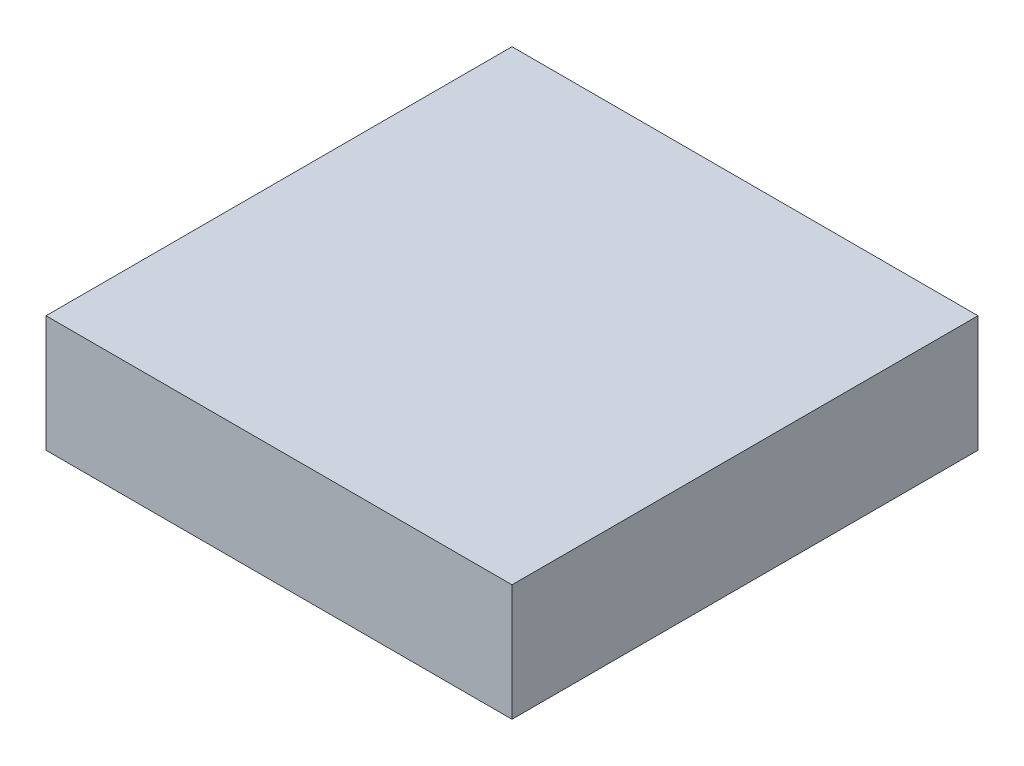
ISO-10303-21;
HEADER;
FILE_DESCRIPTION(('STEP AP214'),'2;1');
FILE_NAME('part.step','',(''),(''),'','','');
FILE_SCHEMA(('AUTOMOTIVE_DESIGN { 1 0 10303 214 1 1 1 1 }'));
ENDSEC;
DATA;
#1=APPLICATION_CONTEXT('core data for automotive mechanical design processes');
#2=APPLICATION_PROTOCOL_DEFINITION('international standard','automotive_design',2000,#1);
#3=PRODUCT_CONTEXT('',#1,'mechanical');
#4=PRODUCT('Part','Part','',(#3));
#5=PRODUCT_RELATED_PRODUCT_CATEGORY('part','',(#4));
#6=PRODUCT_DEFINITION_FORMATION('','',#4);
#7=PRODUCT_DEFINITION_CONTEXT('part definition',#1,'design');
#8=PRODUCT_DEFINITION('design','',#6,#7);
#9=PRODUCT_DEFINITION_SHAPE('','',#8);
#10=(LENGTH_UNIT() NAMED_UNIT(*) SI_UNIT(.MILLI.,.METRE.));
#11=(NAMED_UNIT(*) PLANE_ANGLE_UNIT() SI_UNIT($,.RADIAN.));
#12=(NAMED_UNIT(*) SI_UNIT($,.STERADIAN.) SOLID_ANGLE_UNIT());
#13=UNCERTAINTY_MEASURE_WITH_UNIT(LENGTH_MEASURE(1.E-05),#10,'distance_accuracy_value','');
#14=(GEOMETRIC_REPRESENTATION_CONTEXT(3) GLOBAL_UNCERTAINTY_ASSIGNED_CONTEXT((#13)) GLOBAL_UNIT_ASSIGNED_CONTEXT((#10,
#11,#12)) REPRESENTATION_CONTEXT('',''));
#15=CARTESIAN_POINT('',(0.,0.,0.));
#16=DIRECTION('',(0.,0.,1.));
#17=DIRECTION('',(1.,0.,0.));
#18=AXIS2_PLACEMENT_3D('',#15,#16,#17);
#19=CARTESIAN_POINT('',(12.7,6.35,12.7));
#20=DIRECTION('',(-1.,0.,0.));
#21=DIRECTION('',(0.,0.,1.));
#22=AXIS2_PLACEMENT_3D('',#19,#20,#21);
#23=PLANE('',#22);
#24=DIRECTION('',(0.,0.,-1.));
#25=VECTOR('',#24,1.);
#26=CARTESIAN_POINT('',(12.7,0.,12.7));
#27=LINE('',#26,#25);
#28=CARTESIAN_POINT('',(12.7,0.,12.7));
#29=VERTEX_POINT('',#28);
#30=CARTESIAN_POINT('',(12.7,0.,-12.7));
#31=VERTEX_POINT('',#30);
#32=EDGE_CURVE('E107',#29,#31,#27,.T.);
#33=ORIENTED_EDGE('',*,*,#32,.T.);
#34=DIRECTION('',(0.,-1.,0.));
#35=VECTOR('',#34,1.);
#36=CARTESIAN_POINT('',(12.7,6.35,-12.7));
#37=LINE('',#36,#35);
#38=CARTESIAN_POINT('',(12.7,6.35,-12.7));
#39=VERTEX_POINT('',#38);
#40=EDGE_CURVE('E11',#39,#31,#37,.T.);
#41=ORIENTED_EDGE('',*,*,#40,.F.);
#42=DIRECTION('',(0.,0.,-1.));
#43=VECTOR('',#42,1.);
#44=CARTESIAN_POINT('',(12.7,6.35,12.7));
#45=LINE('',#44,#43);
#46=CARTESIAN_POINT('',(12.7,6.35,12.7));
#47=VERTEX_POINT('',#46);
#48=EDGE_CURVE('E91',#47,#39,#45,.T.);
#49=ORIENTED_EDGE('',*,*,#48,.F.);
#50=DIRECTION('',(0.,-1.,0.));
#51=VECTOR('',#50,1.);
#52=CARTESIAN_POINT('',(12.7,6.35,12.7));
#53=LINE('',#52,#51);
#54=EDGE_CURVE('E103',#47,#29,#53,.T.);
#55=ORIENTED_EDGE('',*,*,#54,.T.);
#56=EDGE_LOOP('',(#33,#41,#49,#55));
#57=FACE_BOUND('',#56,.T.);
#58=ADVANCED_FACE('F39',(#57),#23,.F.);
#59=CARTESIAN_POINT('',(-12.7,6.35,-12.7));
#60=DIRECTION('',(0.,0.,1.));
#61=DIRECTION('',(1.,0.,0.));
#62=AXIS2_PLACEMENT_3D('',#59,#60,#61);
#63=PLANE('',#62);
#64=DIRECTION('',(-1.,0.,0.));
#65=VECTOR('',#64,1.);
#66=CARTESIAN_POINT('',(-12.7,0.,-12.7));
#67=LINE('',#66,#65);
#68=CARTESIAN_POINT('',(-12.7,0.,-12.7));
#69=VERTEX_POINT('',#68);
#70=EDGE_CURVE('E96',#31,#69,#67,.T.);
#71=ORIENTED_EDGE('',*,*,#70,.T.);
#72=DIRECTION('',(0.,-1.,0.));
#73=VECTOR('',#72,1.);
#74=CARTESIAN_POINT('',(-12.7,6.35,-12.7));
#75=LINE('',#74,#73);
#76=CARTESIAN_POINT('',(-12.7,6.35,-12.7));
#77=VERTEX_POINT('',#76);
#78=EDGE_CURVE('E48',#77,#69,#75,.T.);
#79=ORIENTED_EDGE('',*,*,#78,.F.);
#80=DIRECTION('',(-1.,0.,0.));
#81=VECTOR('',#80,1.);
#82=CARTESIAN_POINT('',(-12.7,6.35,-12.7));
#83=LINE('',#82,#81);
#84=EDGE_CURVE('E86',#39,#77,#83,.T.);
#85=ORIENTED_EDGE('',*,*,#84,.F.);
#86=ORIENTED_EDGE('',*,*,#40,.T.);
#87=EDGE_LOOP('',(#71,#79,#85,#86));
#88=FACE_BOUND('',#87,.T.);
#89=ADVANCED_FACE('F95',(#88),#63,.F.);
#90=CARTESIAN_POINT('',(-12.7,6.35,12.7));
#91=DIRECTION('',(1.,0.,0.));
#92=DIRECTION('',(0.,0.,-1.));
#93=AXIS2_PLACEMENT_3D('',#90,#91,#92);
#94=PLANE('',#93);
#95=DIRECTION('',(0.,0.,1.));
#96=VECTOR('',#95,1.);
#97=CARTESIAN_POINT('',(-12.7,0.,12.7));
#98=LINE('',#97,#96);
#99=CARTESIAN_POINT('',(-12.7,0.,12.7));
#100=VERTEX_POINT('',#99);
#101=EDGE_CURVE('E73',#69,#100,#98,.T.);
#102=ORIENTED_EDGE('',*,*,#101,.T.);
#103=DIRECTION('',(0.,-1.,0.));
#104=VECTOR('',#103,1.);
#105=CARTESIAN_POINT('',(-12.7,6.35,12.7));
#106=LINE('',#105,#104);
#107=CARTESIAN_POINT('',(-12.7,6.35,12.7));
#108=VERTEX_POINT('',#107);
#109=EDGE_CURVE('E98',#108,#100,#106,.T.);
#110=ORIENTED_EDGE('',*,*,#109,.F.);
#111=DIRECTION('',(0.,0.,1.));
#112=VECTOR('',#111,1.);
#113=CARTESIAN_POINT('',(-12.7,6.35,12.7));
#114=LINE('',#113,#112);
#115=EDGE_CURVE('E89',#77,#108,#114,.T.);
#116=ORIENTED_EDGE('',*,*,#115,.F.);
#117=ORIENTED_EDGE('',*,*,#78,.T.);
#118=EDGE_LOOP('',(#102,#110,#116,#117));
#119=FACE_BOUND('',#118,.T.);
#120=ADVANCED_FACE('F99',(#119),#94,.F.);
#121=CARTESIAN_POINT('',(-12.7,6.35,12.7));
#122=DIRECTION('',(0.,0.,-1.));
#123=DIRECTION('',(-1.,0.,0.));
#124=AXIS2_PLACEMENT_3D('',#121,#122,#123);
#125=PLANE('',#124);
#126=DIRECTION('',(1.,0.,0.));
#127=VECTOR('',#126,1.);
#128=CARTESIAN_POINT('',(-12.7,0.,12.7));
#129=LINE('',#128,#127);
#130=EDGE_CURVE('E79',#100,#29,#129,.T.);
#131=ORIENTED_EDGE('',*,*,#130,.T.);
#132=ORIENTED_EDGE('',*,*,#54,.F.);
#133=DIRECTION('',(1.,0.,0.));
#134=VECTOR('',#133,1.);
#135=CARTESIAN_POINT('',(-12.7,6.35,12.7));
#136=LINE('',#135,#134);
#137=EDGE_CURVE('E56',#108,#47,#136,.T.);
#138=ORIENTED_EDGE('',*,*,#137,.F.);
#139=ORIENTED_EDGE('',*,*,#109,.T.);
#140=EDGE_LOOP('',(#131,#132,#138,#139));
#141=FACE_BOUND('',#140,.T.);
#142=ADVANCED_FACE('F120',(#141),#125,.F.);
#143=CARTESIAN_POINT('',(0.,6.35,0.));
#144=DIRECTION('',(0.,-1.,0.));
#145=DIRECTION('',(0.,0.,-1.));
#146=AXIS2_PLACEMENT_3D('',#143,#144,#145);
#147=PLANE('',#146);
#148=ORIENTED_EDGE('',*,*,#48,.T.);
#149=ORIENTED_EDGE('',*,*,#84,.T.);
#150=ORIENTED_EDGE('',*,*,#115,.T.);
#151=ORIENTED_EDGE('',*,*,#137,.T.);
#152=EDGE_LOOP('',(#148,#149,#150,#151));
#153=FACE_BOUND('',#152,.T.);
#154=ADVANCED_FACE('F87',(#153),#147,.F.);
#155=CARTESIAN_POINT('',(0.,0.,0.));
#156=DIRECTION('',(0.,-1.,0.));
#157=DIRECTION('',(0.,0.,-1.));
#158=AXIS2_PLACEMENT_3D('',#155,#156,#157);
#159=PLANE('',#158);
#160=ORIENTED_EDGE('',*,*,#32,.F.);
#161=ORIENTED_EDGE('',*,*,#130,.F.);
#162=ORIENTED_EDGE('',*,*,#101,.F.);
#163=ORIENTED_EDGE('',*,*,#70,.F.);
#164=EDGE_LOOP('',(#160,#161,#162,#163));
#165=FACE_BOUND('',#164,.T.);
#166=ADVANCED_FACE('F123',(#165),#159,.T.);
#167=CLOSED_SHELL('',(#58,#89,#120,#142,#154,#166));
#168=MANIFOLD_SOLID_BREP('B2',#167);
#169=ADVANCED_BREP_SHAPE_REPRESENTATION('',(#18,#168),#14);
#170=SHAPE_DEFINITION_REPRESENTATION(#9,#169);
ENDSEC;
END-ISO-10303-21;
